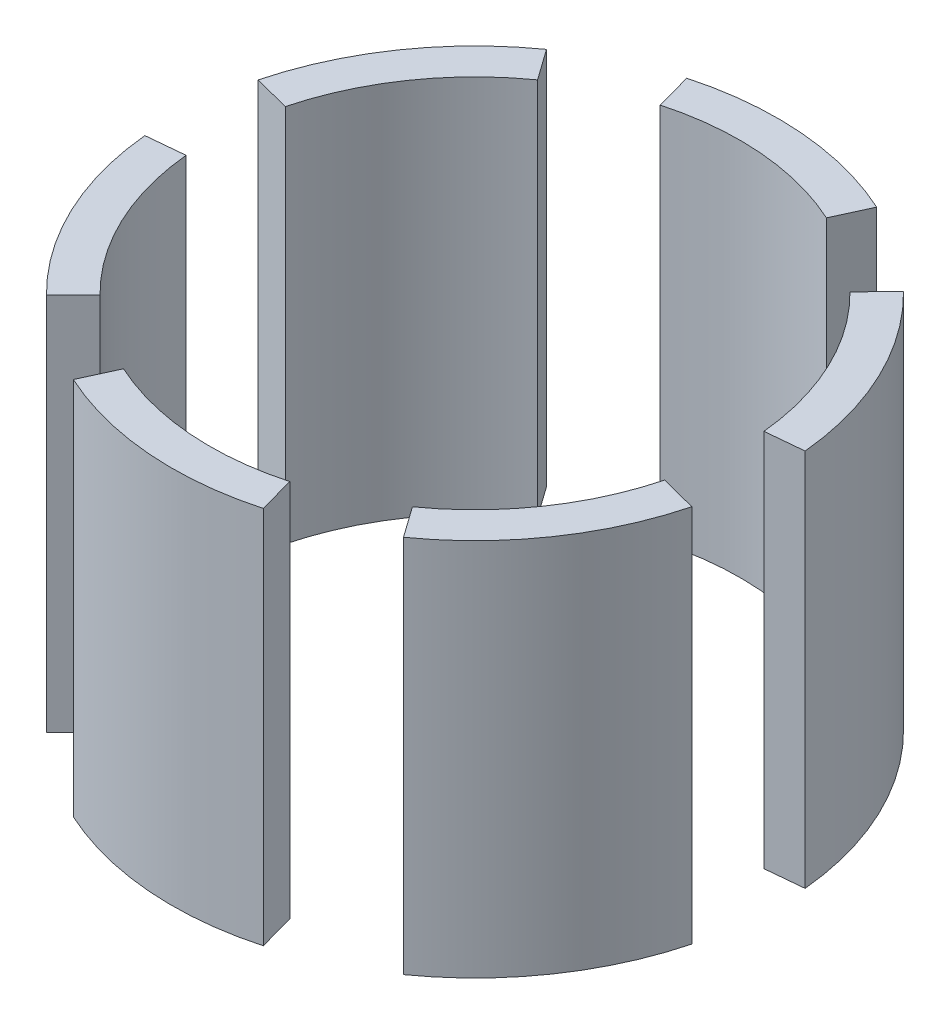
ISO-10303-21;
HEADER;
FILE_DESCRIPTION(('STEP AP214'),'2;1');
FILE_NAME('part.step','',(''),(''),'','','');
FILE_SCHEMA(('AUTOMOTIVE_DESIGN { 1 0 10303 214 1 1 1 1 }'));
ENDSEC;
DATA;
#1=APPLICATION_CONTEXT('core data for automotive mechanical design processes');
#2=APPLICATION_PROTOCOL_DEFINITION('international standard','automotive_design',2000,#1);
#3=PRODUCT_CONTEXT('',#1,'mechanical');
#4=PRODUCT('Part','Part','',(#3));
#5=PRODUCT_RELATED_PRODUCT_CATEGORY('part','',(#4));
#6=PRODUCT_DEFINITION_FORMATION('','',#4);
#7=PRODUCT_DEFINITION_CONTEXT('part definition',#1,'design');
#8=PRODUCT_DEFINITION('design','',#6,#7);
#9=PRODUCT_DEFINITION_SHAPE('','',#8);
#10=(LENGTH_UNIT() NAMED_UNIT(*) SI_UNIT(.MILLI.,.METRE.));
#11=(NAMED_UNIT(*) PLANE_ANGLE_UNIT() SI_UNIT($,.RADIAN.));
#12=(NAMED_UNIT(*) SI_UNIT($,.STERADIAN.) SOLID_ANGLE_UNIT());
#13=UNCERTAINTY_MEASURE_WITH_UNIT(LENGTH_MEASURE(1.E-05),#10,'distance_accuracy_value','');
#14=(GEOMETRIC_REPRESENTATION_CONTEXT(3) GLOBAL_UNCERTAINTY_ASSIGNED_CONTEXT((#13)) GLOBAL_UNIT_ASSIGNED_CONTEXT((#10,
#11,#12)) REPRESENTATION_CONTEXT('',''));
#15=CARTESIAN_POINT('',(0.,0.,0.));
#16=DIRECTION('',(0.,0.,1.));
#17=DIRECTION('',(1.,0.,0.));
#18=AXIS2_PLACEMENT_3D('',#15,#16,#17);
#19=CARTESIAN_POINT('',(0.,25.,0.));
#20=DIRECTION('',(-0.964116029770186,0.,0.265481225588879));
#21=DIRECTION('',(0.265481225588879,0.,0.964116029770186));
#22=AXIS2_PLACEMENT_3D('',#19,#20,#21);
#23=PLANE('',#22);
#24=DIRECTION('',(-0.265481225588879,0.,-0.964116029770186));
#25=VECTOR('',#24,1.);
#26=CARTESIAN_POINT('',(0.,0.,0.));
#27=LINE('',#26,#25);
#28=CARTESIAN_POINT('',(-4.64592144780538,0.,-16.8720305209783));
#29=VERTEX_POINT('',#28);
#30=CARTESIAN_POINT('',(-5.30962451177758,0.,-19.2823205954037));
#31=VERTEX_POINT('',#30);
#32=EDGE_CURVE('E198',#29,#31,#27,.T.);
#33=ORIENTED_EDGE('',*,*,#32,.F.);
#34=DIRECTION('',(0.,-1.,0.));
#35=VECTOR('',#34,1.);
#36=CARTESIAN_POINT('',(-4.64592144780538,25.,-16.8720305209783));
#37=LINE('',#36,#35);
#38=CARTESIAN_POINT('',(-4.64592144780538,25.,-16.8720305209783));
#39=VERTEX_POINT('',#38);
#40=EDGE_CURVE('E166',#29,#39,#37,.F.);
#41=ORIENTED_EDGE('',*,*,#40,.T.);
#42=DIRECTION('',(-0.265481225588879,0.,-0.964116029770186));
#43=VECTOR('',#42,1.);
#44=CARTESIAN_POINT('',(0.,25.,0.));
#45=LINE('',#44,#43);
#46=CARTESIAN_POINT('',(-5.30962451177758,25.,-19.2823205954037));
#47=VERTEX_POINT('',#46);
#48=EDGE_CURVE('E205',#39,#47,#45,.T.);
#49=ORIENTED_EDGE('',*,*,#48,.T.);
#50=DIRECTION('',(0.,-1.,0.));
#51=VECTOR('',#50,1.);
#52=CARTESIAN_POINT('',(-5.30962451177758,25.,-19.2823205954037));
#53=LINE('',#52,#51);
#54=EDGE_CURVE('E13',#47,#31,#53,.T.);
#55=ORIENTED_EDGE('',*,*,#54,.T.);
#56=EDGE_LOOP('',(#33,#41,#49,#55));
#57=FACE_BOUND('',#56,.T.);
#58=ADVANCED_FACE('F151',(#57),#23,.T.);
#59=CARTESIAN_POINT('',(0.,25.,0.));
#60=DIRECTION('',(0.909203769540316,0.,0.416351420621667));
#61=DIRECTION('',(0.416351420621667,0.,-0.909203769540316));
#62=AXIS2_PLACEMENT_3D('',#59,#60,#61);
#63=PLANE('',#62);
#64=DIRECTION('',(-0.416351420621667,0.,0.909203769540316));
#65=VECTOR('',#64,1.);
#66=CARTESIAN_POINT('',(0.,25.,0.));
#67=LINE('',#66,#65);
#68=CARTESIAN_POINT('',(8.32702841243334,25.,-18.1840753908063));
#69=VERTEX_POINT('',#68);
#70=CARTESIAN_POINT('',(7.28614986087917,25.,-15.9110659669555));
#71=VERTEX_POINT('',#70);
#72=EDGE_CURVE('E192',#69,#71,#67,.T.);
#73=ORIENTED_EDGE('',*,*,#72,.T.);
#74=DIRECTION('',(0.,-1.,0.));
#75=VECTOR('',#74,1.);
#76=CARTESIAN_POINT('',(7.28614986087917,25.,-15.9110659669555));
#77=LINE('',#76,#75);
#78=CARTESIAN_POINT('',(7.28614986087917,0.,-15.9110659669555));
#79=VERTEX_POINT('',#78);
#80=EDGE_CURVE('E203',#71,#79,#77,.T.);
#81=ORIENTED_EDGE('',*,*,#80,.T.);
#82=DIRECTION('',(-0.416351420621667,0.,0.909203769540316));
#83=VECTOR('',#82,1.);
#84=CARTESIAN_POINT('',(0.,0.,0.));
#85=LINE('',#84,#83);
#86=CARTESIAN_POINT('',(8.32702841243334,0.,-18.1840753908063));
#87=VERTEX_POINT('',#86);
#88=EDGE_CURVE('E196',#87,#79,#85,.T.);
#89=ORIENTED_EDGE('',*,*,#88,.F.);
#90=DIRECTION('',(0.,-1.,0.));
#91=VECTOR('',#90,1.);
#92=CARTESIAN_POINT('',(8.32702841243334,25.,-18.1840753908063));
#93=LINE('',#92,#91);
#94=EDGE_CURVE('E159',#69,#87,#93,.T.);
#95=ORIENTED_EDGE('',*,*,#94,.F.);
#96=EDGE_LOOP('',(#73,#81,#89,#95));
#97=FACE_BOUND('',#96,.T.);
#98=ADVANCED_FACE('F201',(#97),#63,.T.);
#99=CARTESIAN_POINT('',(0.,25.,0.));
#100=DIRECTION('',(0.,-1.,0.));
#101=DIRECTION('',(0.,0.,-1.));
#102=AXIS2_PLACEMENT_3D('',#99,#100,#101);
#103=CYLINDRICAL_SURFACE('',#102,20.);
#104=CARTESIAN_POINT('',(0.,0.,0.));
#105=DIRECTION('',(0.,1.,0.));
#106=DIRECTION('',(0.,0.,1.));
#107=AXIS2_PLACEMENT_3D('',#104,#105,#106);
#108=CIRCLE('',#107,20.);
#109=EDGE_CURVE('E188',#31,#87,#108,.F.);
#110=ORIENTED_EDGE('',*,*,#109,.F.);
#111=ORIENTED_EDGE('',*,*,#54,.F.);
#112=CARTESIAN_POINT('',(0.,25.,0.));
#113=DIRECTION('',(0.,1.,0.));
#114=DIRECTION('',(0.,0.,1.));
#115=AXIS2_PLACEMENT_3D('',#112,#113,#114);
#116=CIRCLE('',#115,20.);
#117=EDGE_CURVE('E190',#47,#69,#116,.F.);
#118=ORIENTED_EDGE('',*,*,#117,.T.);
#119=ORIENTED_EDGE('',*,*,#94,.T.);
#120=EDGE_LOOP('',(#110,#111,#118,#119));
#121=FACE_BOUND('',#120,.T.);
#122=ADVANCED_FACE('F153',(#121),#103,.T.);
#123=CARTESIAN_POINT('',(0.,25.,0.));
#124=DIRECTION('',(0.,1.,0.));
#125=DIRECTION('',(0.,0.,1.));
#126=AXIS2_PLACEMENT_3D('',#123,#124,#125);
#127=PLANE('',#126);
#128=ORIENTED_EDGE('',*,*,#48,.F.);
#129=CARTESIAN_POINT('',(0.,25.,0.));
#130=DIRECTION('',(0.,1.,0.));
#131=DIRECTION('',(0.,0.,1.));
#132=AXIS2_PLACEMENT_3D('',#129,#130,#131);
#133=CIRCLE('',#132,17.5);
#134=EDGE_CURVE('E213',#71,#39,#133,.T.);
#135=ORIENTED_EDGE('',*,*,#134,.F.);
#136=ORIENTED_EDGE('',*,*,#72,.F.);
#137=ORIENTED_EDGE('',*,*,#117,.F.);
#138=EDGE_LOOP('',(#128,#135,#136,#137));
#139=FACE_BOUND('',#138,.T.);
#140=ADVANCED_FACE('F224',(#139),#127,.T.);
#141=CARTESIAN_POINT('',(0.,0.,0.));
#142=DIRECTION('',(0.,1.,0.));
#143=DIRECTION('',(0.,0.,1.));
#144=AXIS2_PLACEMENT_3D('',#141,#142,#143);
#145=PLANE('',#144);
#146=CARTESIAN_POINT('',(0.,0.,0.));
#147=DIRECTION('',(0.,1.,0.));
#148=DIRECTION('',(0.,0.,1.));
#149=AXIS2_PLACEMENT_3D('',#146,#147,#148);
#150=CIRCLE('',#149,17.5);
#151=EDGE_CURVE('E214',#79,#29,#150,.T.);
#152=ORIENTED_EDGE('',*,*,#151,.T.);
#153=ORIENTED_EDGE('',*,*,#32,.T.);
#154=ORIENTED_EDGE('',*,*,#109,.T.);
#155=ORIENTED_EDGE('',*,*,#88,.T.);
#156=EDGE_LOOP('',(#152,#153,#154,#155));
#157=FACE_BOUND('',#156,.T.);
#158=ADVANCED_FACE('F195',(#157),#145,.F.);
#159=CARTESIAN_POINT('',(0.,25.,0.));
#160=DIRECTION('',(0.,-1.,0.));
#161=DIRECTION('',(0.,0.,-1.));
#162=AXIS2_PLACEMENT_3D('',#159,#160,#161);
#163=CYLINDRICAL_SURFACE('',#162,17.5);
#164=ORIENTED_EDGE('',*,*,#151,.F.);
#165=ORIENTED_EDGE('',*,*,#80,.F.);
#166=ORIENTED_EDGE('',*,*,#134,.T.);
#167=ORIENTED_EDGE('',*,*,#40,.F.);
#168=EDGE_LOOP('',(#164,#165,#166,#167));
#169=FACE_BOUND('',#168,.T.);
#170=ADVANCED_FACE('F218',(#169),#163,.F.);
#171=CLOSED_SHELL('',(#58,#98,#122,#140,#158,#170));
#172=MANIFOLD_SOLID_BREP('B2',#171);
#173=CARTESIAN_POINT('',(0.,25.,0.));
#174=DIRECTION('',(-0.711971500472888,0.,-0.702208361182338));
#175=DIRECTION('',(-0.702208361182338,0.,0.711971500472888));
#176=AXIS2_PLACEMENT_3D('',#173,#174,#175);
#177=PLANE('',#176);
#178=DIRECTION('',(0.702208361182338,0.,-0.711971500472888));
#179=VECTOR('',#178,1.);
#180=CARTESIAN_POINT('',(0.,0.,0.));
#181=LINE('',#180,#179);
#182=CARTESIAN_POINT('',(12.2886463206909,0.,-12.4595012582755));
#183=VERTEX_POINT('',#182);
#184=CARTESIAN_POINT('',(14.0441672236468,0.,-14.2394300094578));
#185=VERTEX_POINT('',#184);
#186=EDGE_CURVE('E331',#183,#185,#181,.T.);
#187=ORIENTED_EDGE('',*,*,#186,.F.);
#188=DIRECTION('',(0.,-1.,0.));
#189=VECTOR('',#188,1.);
#190=CARTESIAN_POINT('',(12.2886463206909,25.,-12.4595012582755));
#191=LINE('',#190,#189);
#192=CARTESIAN_POINT('',(12.2886463206909,25.,-12.4595012582755));
#193=VERTEX_POINT('',#192);
#194=EDGE_CURVE('E299',#183,#193,#191,.F.);
#195=ORIENTED_EDGE('',*,*,#194,.T.);
#196=DIRECTION('',(0.702208361182338,0.,-0.711971500472888));
#197=VECTOR('',#196,1.);
#198=CARTESIAN_POINT('',(0.,25.,0.));
#199=LINE('',#198,#197);
#200=CARTESIAN_POINT('',(14.0441672236468,25.,-14.2394300094578));
#201=VERTEX_POINT('',#200);
#202=EDGE_CURVE('E338',#193,#201,#199,.T.);
#203=ORIENTED_EDGE('',*,*,#202,.T.);
#204=DIRECTION('',(0.,-1.,0.));
#205=VECTOR('',#204,1.);
#206=CARTESIAN_POINT('',(14.0441672236468,25.,-14.2394300094578));
#207=LINE('',#206,#205);
#208=EDGE_CURVE('E149',#201,#185,#207,.T.);
#209=ORIENTED_EDGE('',*,*,#208,.T.);
#210=EDGE_LOOP('',(#187,#195,#203,#209));
#211=FACE_BOUND('',#210,.T.);
#212=ADVANCED_FACE('F284',(#211),#177,.T.);
#213=CARTESIAN_POINT('',(0.,25.,0.));
#214=DIRECTION('',(0.0940309776100518,0.,0.995569271949319));
#215=DIRECTION('',(0.995569271949319,0.,-0.0940309776100518));
#216=AXIS2_PLACEMENT_3D('',#213,#214,#215);
#217=PLANE('',#216);
#218=DIRECTION('',(-0.995569271949319,0.,0.0940309776100518));
#219=VECTOR('',#218,1.);
#220=CARTESIAN_POINT('',(0.,25.,0.));
#221=LINE('',#220,#219);
#222=CARTESIAN_POINT('',(19.9113854389864,25.,-1.88061955220104));
#223=VERTEX_POINT('',#222);
#224=CARTESIAN_POINT('',(17.4224622591131,25.,-1.64554210817591));
#225=VERTEX_POINT('',#224);
#226=EDGE_CURVE('E325',#223,#225,#221,.T.);
#227=ORIENTED_EDGE('',*,*,#226,.T.);
#228=DIRECTION('',(0.,-1.,0.));
#229=VECTOR('',#228,1.);
#230=CARTESIAN_POINT('',(17.4224622591131,25.,-1.64554210817591));
#231=LINE('',#230,#229);
#232=CARTESIAN_POINT('',(17.4224622591131,0.,-1.64554210817591));
#233=VERTEX_POINT('',#232);
#234=EDGE_CURVE('E336',#225,#233,#231,.T.);
#235=ORIENTED_EDGE('',*,*,#234,.T.);
#236=DIRECTION('',(-0.995569271949319,0.,0.0940309776100518));
#237=VECTOR('',#236,1.);
#238=CARTESIAN_POINT('',(0.,0.,0.));
#239=LINE('',#238,#237);
#240=CARTESIAN_POINT('',(19.9113854389864,0.,-1.88061955220104));
#241=VERTEX_POINT('',#240);
#242=EDGE_CURVE('E329',#241,#233,#239,.T.);
#243=ORIENTED_EDGE('',*,*,#242,.F.);
#244=DIRECTION('',(0.,-1.,0.));
#245=VECTOR('',#244,1.);
#246=CARTESIAN_POINT('',(19.9113854389864,25.,-1.88061955220104));
#247=LINE('',#246,#245);
#248=EDGE_CURVE('E292',#223,#241,#247,.T.);
#249=ORIENTED_EDGE('',*,*,#248,.F.);
#250=EDGE_LOOP('',(#227,#235,#243,#249));
#251=FACE_BOUND('',#250,.T.);
#252=ADVANCED_FACE('F334',(#251),#217,.T.);
#253=CARTESIAN_POINT('',(0.,25.,0.));
#254=DIRECTION('',(0.,-1.,0.));
#255=DIRECTION('',(0.,0.,-1.));
#256=AXIS2_PLACEMENT_3D('',#253,#254,#255);
#257=CYLINDRICAL_SURFACE('',#256,20.);
#258=CARTESIAN_POINT('',(0.,0.,0.));
#259=DIRECTION('',(0.,1.,0.));
#260=DIRECTION('',(0.,0.,1.));
#261=AXIS2_PLACEMENT_3D('',#258,#259,#260);
#262=CIRCLE('',#261,20.);
#263=EDGE_CURVE('E321',#185,#241,#262,.F.);
#264=ORIENTED_EDGE('',*,*,#263,.F.);
#265=ORIENTED_EDGE('',*,*,#208,.F.);
#266=CARTESIAN_POINT('',(0.,25.,0.));
#267=DIRECTION('',(0.,1.,0.));
#268=DIRECTION('',(0.,0.,1.));
#269=AXIS2_PLACEMENT_3D('',#266,#267,#268);
#270=CIRCLE('',#269,20.);
#271=EDGE_CURVE('E323',#201,#223,#270,.F.);
#272=ORIENTED_EDGE('',*,*,#271,.T.);
#273=ORIENTED_EDGE('',*,*,#248,.T.);
#274=EDGE_LOOP('',(#264,#265,#272,#273));
#275=FACE_BOUND('',#274,.T.);
#276=ADVANCED_FACE('F286',(#275),#257,.T.);
#277=CARTESIAN_POINT('',(0.,25.,0.));
#278=DIRECTION('',(0.,1.,0.));
#279=DIRECTION('',(0.,0.,1.));
#280=AXIS2_PLACEMENT_3D('',#277,#278,#279);
#281=PLANE('',#280);
#282=ORIENTED_EDGE('',*,*,#202,.F.);
#283=CARTESIAN_POINT('',(0.,25.,0.));
#284=DIRECTION('',(0.,1.,0.));
#285=DIRECTION('',(0.,0.,1.));
#286=AXIS2_PLACEMENT_3D('',#283,#284,#285);
#287=CIRCLE('',#286,17.5);
#288=EDGE_CURVE('E346',#225,#193,#287,.T.);
#289=ORIENTED_EDGE('',*,*,#288,.F.);
#290=ORIENTED_EDGE('',*,*,#226,.F.);
#291=ORIENTED_EDGE('',*,*,#271,.F.);
#292=EDGE_LOOP('',(#282,#289,#290,#291));
#293=FACE_BOUND('',#292,.T.);
#294=ADVANCED_FACE('F357',(#293),#281,.T.);
#295=CARTESIAN_POINT('',(0.,0.,0.));
#296=DIRECTION('',(0.,1.,0.));
#297=DIRECTION('',(0.,0.,1.));
#298=AXIS2_PLACEMENT_3D('',#295,#296,#297);
#299=PLANE('',#298);
#300=CARTESIAN_POINT('',(0.,0.,0.));
#301=DIRECTION('',(0.,1.,0.));
#302=DIRECTION('',(0.,0.,1.));
#303=AXIS2_PLACEMENT_3D('',#300,#301,#302);
#304=CIRCLE('',#303,17.5);
#305=EDGE_CURVE('E347',#233,#183,#304,.T.);
#306=ORIENTED_EDGE('',*,*,#305,.T.);
#307=ORIENTED_EDGE('',*,*,#186,.T.);
#308=ORIENTED_EDGE('',*,*,#263,.T.);
#309=ORIENTED_EDGE('',*,*,#242,.T.);
#310=EDGE_LOOP('',(#306,#307,#308,#309));
#311=FACE_BOUND('',#310,.T.);
#312=ADVANCED_FACE('F328',(#311),#299,.F.);
#313=CARTESIAN_POINT('',(0.,25.,0.));
#314=DIRECTION('',(0.,-1.,0.));
#315=DIRECTION('',(0.,0.,-1.));
#316=AXIS2_PLACEMENT_3D('',#313,#314,#315);
#317=CYLINDRICAL_SURFACE('',#316,17.5);
#318=ORIENTED_EDGE('',*,*,#305,.F.);
#319=ORIENTED_EDGE('',*,*,#234,.F.);
#320=ORIENTED_EDGE('',*,*,#288,.T.);
#321=ORIENTED_EDGE('',*,*,#194,.F.);
#322=EDGE_LOOP('',(#318,#319,#320,#321));
#323=FACE_BOUND('',#322,.T.);
#324=ADVANCED_FACE('F351',(#323),#317,.F.);
#325=CLOSED_SHELL('',(#212,#252,#276,#294,#312,#324));
#326=MANIFOLD_SOLID_BREP('B7',#325);
#327=CARTESIAN_POINT('',(0.,25.,0.));
#328=DIRECTION('',(0.252144529297301,0.,-0.967689586771214));
#329=DIRECTION('',(-0.967689586771214,0.,-0.252144529297301));
#330=AXIS2_PLACEMENT_3D('',#327,#328,#329);
#331=PLANE('',#330);
#332=DIRECTION('',(0.967689586771214,0.,0.252144529297301));
#333=VECTOR('',#332,1.);
#334=CARTESIAN_POINT('',(0.,0.,0.));
#335=LINE('',#334,#333);
#336=CARTESIAN_POINT('',(16.9345677684962,0.,4.41252926270277));
#337=VERTEX_POINT('',#336);
#338=CARTESIAN_POINT('',(19.3537917354243,0.,5.04289058594602));
#339=VERTEX_POINT('',#338);
#340=EDGE_CURVE('E464',#337,#339,#335,.T.);
#341=ORIENTED_EDGE('',*,*,#340,.F.);
#342=DIRECTION('',(0.,-1.,0.));
#343=VECTOR('',#342,1.);
#344=CARTESIAN_POINT('',(16.9345677684962,25.,4.41252926270277));
#345=LINE('',#344,#343);
#346=CARTESIAN_POINT('',(16.9345677684962,25.,4.41252926270277));
#347=VERTEX_POINT('',#346);
#348=EDGE_CURVE('E432',#337,#347,#345,.F.);
#349=ORIENTED_EDGE('',*,*,#348,.T.);
#350=DIRECTION('',(0.967689586771214,0.,0.252144529297301));
#351=VECTOR('',#350,1.);
#352=CARTESIAN_POINT('',(0.,25.,0.));
#353=LINE('',#352,#351);
#354=CARTESIAN_POINT('',(19.3537917354243,25.,5.04289058594602));
#355=VERTEX_POINT('',#354);
#356=EDGE_CURVE('E471',#347,#355,#353,.T.);
#357=ORIENTED_EDGE('',*,*,#356,.T.);
#358=DIRECTION('',(0.,-1.,0.));
#359=VECTOR('',#358,1.);
#360=CARTESIAN_POINT('',(19.3537917354243,25.,5.04289058594602));
#361=LINE('',#360,#359);
#362=EDGE_CURVE('E282',#355,#339,#361,.T.);
#363=ORIENTED_EDGE('',*,*,#362,.T.);
#364=EDGE_LOOP('',(#341,#349,#357,#363));
#365=FACE_BOUND('',#364,.T.);
#366=ADVANCED_FACE('F417',(#365),#331,.T.);
#367=CARTESIAN_POINT('',(0.,25.,0.));
#368=DIRECTION('',(-0.815172791930264,0.,0.579217851327648));
#369=DIRECTION('',(0.579217851327648,0.,0.815172791930264));
#370=AXIS2_PLACEMENT_3D('',#367,#368,#369);
#371=PLANE('',#370);
#372=DIRECTION('',(-0.579217851327648,0.,-0.815172791930264));
#373=VECTOR('',#372,1.);
#374=CARTESIAN_POINT('',(0.,25.,0.));
#375=LINE('',#374,#373);
#376=CARTESIAN_POINT('',(11.584357026553,25.,16.3034558386053));
#377=VERTEX_POINT('',#376);
#378=CARTESIAN_POINT('',(10.1363123982338,25.,14.2655238587796));
#379=VERTEX_POINT('',#378);
#380=EDGE_CURVE('E458',#377,#379,#375,.T.);
#381=ORIENTED_EDGE('',*,*,#380,.T.);
#382=DIRECTION('',(0.,-1.,0.));
#383=VECTOR('',#382,1.);
#384=CARTESIAN_POINT('',(10.1363123982338,25.,14.2655238587796));
#385=LINE('',#384,#383);
#386=CARTESIAN_POINT('',(10.1363123982338,0.,14.2655238587796));
#387=VERTEX_POINT('',#386);
#388=EDGE_CURVE('E469',#379,#387,#385,.T.);
#389=ORIENTED_EDGE('',*,*,#388,.T.);
#390=DIRECTION('',(-0.579217851327648,0.,-0.815172791930264));
#391=VECTOR('',#390,1.);
#392=CARTESIAN_POINT('',(0.,0.,0.));
#393=LINE('',#392,#391);
#394=CARTESIAN_POINT('',(11.584357026553,0.,16.3034558386053));
#395=VERTEX_POINT('',#394);
#396=EDGE_CURVE('E462',#395,#387,#393,.T.);
#397=ORIENTED_EDGE('',*,*,#396,.F.);
#398=DIRECTION('',(0.,-1.,0.));
#399=VECTOR('',#398,1.);
#400=CARTESIAN_POINT('',(11.584357026553,25.,16.3034558386053));
#401=LINE('',#400,#399);
#402=EDGE_CURVE('E425',#377,#395,#401,.T.);
#403=ORIENTED_EDGE('',*,*,#402,.F.);
#404=EDGE_LOOP('',(#381,#389,#397,#403));
#405=FACE_BOUND('',#404,.T.);
#406=ADVANCED_FACE('F467',(#405),#371,.T.);
#407=CARTESIAN_POINT('',(0.,25.,0.));
#408=DIRECTION('',(0.,-1.,0.));
#409=DIRECTION('',(0.,0.,-1.));
#410=AXIS2_PLACEMENT_3D('',#407,#408,#409);
#411=CYLINDRICAL_SURFACE('',#410,20.);
#412=CARTESIAN_POINT('',(0.,0.,0.));
#413=DIRECTION('',(0.,1.,0.));
#414=DIRECTION('',(0.,0.,1.));
#415=AXIS2_PLACEMENT_3D('',#412,#413,#414);
#416=CIRCLE('',#415,20.);
#417=EDGE_CURVE('E454',#339,#395,#416,.F.);
#418=ORIENTED_EDGE('',*,*,#417,.F.);
#419=ORIENTED_EDGE('',*,*,#362,.F.);
#420=CARTESIAN_POINT('',(0.,25.,0.));
#421=DIRECTION('',(0.,1.,0.));
#422=DIRECTION('',(0.,0.,1.));
#423=AXIS2_PLACEMENT_3D('',#420,#421,#422);
#424=CIRCLE('',#423,20.);
#425=EDGE_CURVE('E456',#355,#377,#424,.F.);
#426=ORIENTED_EDGE('',*,*,#425,.T.);
#427=ORIENTED_EDGE('',*,*,#402,.T.);
#428=EDGE_LOOP('',(#418,#419,#426,#427));
#429=FACE_BOUND('',#428,.T.);
#430=ADVANCED_FACE('F419',(#429),#411,.T.);
#431=CARTESIAN_POINT('',(0.,25.,0.));
#432=DIRECTION('',(0.,1.,0.));
#433=DIRECTION('',(0.,0.,1.));
#434=AXIS2_PLACEMENT_3D('',#431,#432,#433);
#435=PLANE('',#434);
#436=ORIENTED_EDGE('',*,*,#356,.F.);
#437=CARTESIAN_POINT('',(0.,25.,0.));
#438=DIRECTION('',(0.,1.,0.));
#439=DIRECTION('',(0.,0.,1.));
#440=AXIS2_PLACEMENT_3D('',#437,#438,#439);
#441=CIRCLE('',#440,17.5);
#442=EDGE_CURVE('E479',#379,#347,#441,.T.);
#443=ORIENTED_EDGE('',*,*,#442,.F.);
#444=ORIENTED_EDGE('',*,*,#380,.F.);
#445=ORIENTED_EDGE('',*,*,#425,.F.);
#446=EDGE_LOOP('',(#436,#443,#444,#445));
#447=FACE_BOUND('',#446,.T.);
#448=ADVANCED_FACE('F490',(#447),#435,.T.);
#449=CARTESIAN_POINT('',(0.,0.,0.));
#450=DIRECTION('',(0.,1.,0.));
#451=DIRECTION('',(0.,0.,1.));
#452=AXIS2_PLACEMENT_3D('',#449,#450,#451);
#453=PLANE('',#452);
#454=CARTESIAN_POINT('',(0.,0.,0.));
#455=DIRECTION('',(0.,1.,0.));
#456=DIRECTION('',(0.,0.,1.));
#457=AXIS2_PLACEMENT_3D('',#454,#455,#456);
#458=CIRCLE('',#457,17.5);
#459=EDGE_CURVE('E480',#387,#337,#458,.T.);
#460=ORIENTED_EDGE('',*,*,#459,.T.);
#461=ORIENTED_EDGE('',*,*,#340,.T.);
#462=ORIENTED_EDGE('',*,*,#417,.T.);
#463=ORIENTED_EDGE('',*,*,#396,.T.);
#464=EDGE_LOOP('',(#460,#461,#462,#463));
#465=FACE_BOUND('',#464,.T.);
#466=ADVANCED_FACE('F461',(#465),#453,.F.);
#467=CARTESIAN_POINT('',(0.,25.,0.));
#468=DIRECTION('',(0.,-1.,0.));
#469=DIRECTION('',(0.,0.,-1.));
#470=AXIS2_PLACEMENT_3D('',#467,#468,#469);
#471=CYLINDRICAL_SURFACE('',#470,17.5);
#472=ORIENTED_EDGE('',*,*,#459,.F.);
#473=ORIENTED_EDGE('',*,*,#388,.F.);
#474=ORIENTED_EDGE('',*,*,#442,.T.);
#475=ORIENTED_EDGE('',*,*,#348,.F.);
#476=EDGE_LOOP('',(#472,#473,#474,#475));
#477=FACE_BOUND('',#476,.T.);
#478=ADVANCED_FACE('F484',(#477),#471,.F.);
#479=CLOSED_SHELL('',(#366,#406,#430,#448,#466,#478));
#480=MANIFOLD_SOLID_BREP('B143',#479);
#481=CARTESIAN_POINT('',(0.,25.,0.));
#482=DIRECTION('',(0.964116029770185,0.,-0.265481225588886));
#483=DIRECTION('',(-0.265481225588886,0.,-0.964116029770185));
#484=AXIS2_PLACEMENT_3D('',#481,#482,#483);
#485=PLANE('',#484);
#486=DIRECTION('',(0.265481225588886,0.,0.964116029770185));
#487=VECTOR('',#486,1.);
#488=CARTESIAN_POINT('',(0.,0.,0.));
#489=LINE('',#488,#487);
#490=CARTESIAN_POINT('',(4.6459214478055,0.,16.8720305209782));
#491=VERTEX_POINT('',#490);
#492=CARTESIAN_POINT('',(5.30962451177771,0.,19.2823205954037));
#493=VERTEX_POINT('',#492);
#494=EDGE_CURVE('E598',#491,#493,#489,.T.);
#495=ORIENTED_EDGE('',*,*,#494,.F.);
#496=DIRECTION('',(0.,-1.,0.));
#497=VECTOR('',#496,1.);
#498=CARTESIAN_POINT('',(4.6459214478055,25.,16.8720305209782));
#499=LINE('',#498,#497);
#500=CARTESIAN_POINT('',(4.6459214478055,25.,16.8720305209782));
#501=VERTEX_POINT('',#500);
#502=EDGE_CURVE('E564',#491,#501,#499,.F.);
#503=ORIENTED_EDGE('',*,*,#502,.T.);
#504=DIRECTION('',(0.265481225588886,0.,0.964116029770185));
#505=VECTOR('',#504,1.);
#506=CARTESIAN_POINT('',(0.,25.,0.));
#507=LINE('',#506,#505);
#508=CARTESIAN_POINT('',(5.30962451177771,25.,19.2823205954037));
#509=VERTEX_POINT('',#508);
#510=EDGE_CURVE('E606',#501,#509,#507,.T.);
#511=ORIENTED_EDGE('',*,*,#510,.T.);
#512=DIRECTION('',(0.,-1.,0.));
#513=VECTOR('',#512,1.);
#514=CARTESIAN_POINT('',(5.30962451177771,25.,19.2823205954037));
#515=LINE('',#514,#513);
#516=EDGE_CURVE('E558',#509,#493,#515,.T.);
#517=ORIENTED_EDGE('',*,*,#516,.T.);
#518=EDGE_LOOP('',(#495,#503,#511,#517));
#519=FACE_BOUND('',#518,.T.);
#520=ADVANCED_FACE('F550',(#519),#485,.T.);
#521=CARTESIAN_POINT('',(0.,25.,0.));
#522=DIRECTION('',(-0.909203769540319,0.,-0.416351420621661));
#523=DIRECTION('',(-0.416351420621661,0.,0.909203769540319));
#524=AXIS2_PLACEMENT_3D('',#521,#522,#523);
#525=PLANE('',#524);
#526=DIRECTION('',(0.416351420621661,0.,-0.909203769540319));
#527=VECTOR('',#526,1.);
#528=CARTESIAN_POINT('',(0.,25.,0.));
#529=LINE('',#528,#527);
#530=CARTESIAN_POINT('',(-8.32702841243322,25.,18.1840753908064));
#531=VERTEX_POINT('',#530);
#532=CARTESIAN_POINT('',(-7.28614986087906,25.,15.9110659669556));
#533=VERTEX_POINT('',#532);
#534=EDGE_CURVE('E591',#531,#533,#529,.T.);
#535=ORIENTED_EDGE('',*,*,#534,.T.);
#536=DIRECTION('',(0.,-1.,0.));
#537=VECTOR('',#536,1.);
#538=CARTESIAN_POINT('',(-7.28614986087906,25.,15.9110659669556));
#539=LINE('',#538,#537);
#540=CARTESIAN_POINT('',(-7.28614986087906,0.,15.9110659669556));
#541=VERTEX_POINT('',#540);
#542=EDGE_CURVE('E604',#533,#541,#539,.T.);
#543=ORIENTED_EDGE('',*,*,#542,.T.);
#544=DIRECTION('',(0.416351420621661,0.,-0.909203769540319));
#545=VECTOR('',#544,1.);
#546=CARTESIAN_POINT('',(0.,0.,0.));
#547=LINE('',#546,#545);
#548=CARTESIAN_POINT('',(-8.32702841243322,0.,18.1840753908064));
#549=VERTEX_POINT('',#548);
#550=EDGE_CURVE('E596',#549,#541,#547,.T.);
#551=ORIENTED_EDGE('',*,*,#550,.F.);
#552=DIRECTION('',(0.,-1.,0.));
#553=VECTOR('',#552,1.);
#554=CARTESIAN_POINT('',(-8.32702841243322,25.,18.1840753908064));
#555=LINE('',#554,#553);
#556=EDGE_CURVE('E573',#531,#549,#555,.T.);
#557=ORIENTED_EDGE('',*,*,#556,.F.);
#558=EDGE_LOOP('',(#535,#543,#551,#557));
#559=FACE_BOUND('',#558,.T.);
#560=ADVANCED_FACE('F602',(#559),#525,.T.);
#561=CARTESIAN_POINT('',(0.,25.,0.));
#562=DIRECTION('',(0.,-1.,0.));
#563=DIRECTION('',(0.,0.,-1.));
#564=AXIS2_PLACEMENT_3D('',#561,#562,#563);
#565=CYLINDRICAL_SURFACE('',#564,20.);
#566=CARTESIAN_POINT('',(0.,0.,0.));
#567=DIRECTION('',(0.,1.,0.));
#568=DIRECTION('',(0.,0.,1.));
#569=AXIS2_PLACEMENT_3D('',#566,#567,#568);
#570=CIRCLE('',#569,20.);
#571=EDGE_CURVE('E587',#493,#549,#570,.F.);
#572=ORIENTED_EDGE('',*,*,#571,.F.);
#573=ORIENTED_EDGE('',*,*,#516,.F.);
#574=CARTESIAN_POINT('',(0.,25.,0.));
#575=DIRECTION('',(0.,1.,0.));
#576=DIRECTION('',(0.,0.,1.));
#577=AXIS2_PLACEMENT_3D('',#574,#575,#576);
#578=CIRCLE('',#577,20.);
#579=EDGE_CURVE('E589',#509,#531,#578,.F.);
#580=ORIENTED_EDGE('',*,*,#579,.T.);
#581=ORIENTED_EDGE('',*,*,#556,.T.);
#582=EDGE_LOOP('',(#572,#573,#580,#581));
#583=FACE_BOUND('',#582,.T.);
#584=ADVANCED_FACE('F552',(#583),#565,.T.);
#585=CARTESIAN_POINT('',(0.,25.,0.));
#586=DIRECTION('',(0.,1.,0.));
#587=DIRECTION('',(0.,0.,1.));
#588=AXIS2_PLACEMENT_3D('',#585,#586,#587);
#589=PLANE('',#588);
#590=ORIENTED_EDGE('',*,*,#510,.F.);
#591=CARTESIAN_POINT('',(0.,25.,0.));
#592=DIRECTION('',(0.,1.,0.));
#593=DIRECTION('',(0.,0.,1.));
#594=AXIS2_PLACEMENT_3D('',#591,#592,#593);
#595=CIRCLE('',#594,17.5);
#596=EDGE_CURVE('E616',#533,#501,#595,.T.);
#597=ORIENTED_EDGE('',*,*,#596,.F.);
#598=ORIENTED_EDGE('',*,*,#534,.F.);
#599=ORIENTED_EDGE('',*,*,#579,.F.);
#600=EDGE_LOOP('',(#590,#597,#598,#599));
#601=FACE_BOUND('',#600,.T.);
#602=ADVANCED_FACE('F612',(#601),#589,.T.);
#603=CARTESIAN_POINT('',(0.,0.,0.));
#604=DIRECTION('',(0.,1.,0.));
#605=DIRECTION('',(0.,0.,1.));
#606=AXIS2_PLACEMENT_3D('',#603,#604,#605);
#607=PLANE('',#606);
#608=CARTESIAN_POINT('',(0.,0.,0.));
#609=DIRECTION('',(0.,1.,0.));
#610=DIRECTION('',(0.,0.,1.));
#611=AXIS2_PLACEMENT_3D('',#608,#609,#610);
#612=CIRCLE('',#611,17.5);
#613=EDGE_CURVE('E415',#491,#541,#612,.F.);
#614=ORIENTED_EDGE('',*,*,#613,.F.);
#615=ORIENTED_EDGE('',*,*,#494,.T.);
#616=ORIENTED_EDGE('',*,*,#571,.T.);
#617=ORIENTED_EDGE('',*,*,#550,.T.);
#618=EDGE_LOOP('',(#614,#615,#616,#617));
#619=FACE_BOUND('',#618,.T.);
#620=ADVANCED_FACE('F595',(#619),#607,.F.);
#621=CARTESIAN_POINT('',(0.,25.,0.));
#622=DIRECTION('',(0.,-1.,0.));
#623=DIRECTION('',(0.,0.,-1.));
#624=AXIS2_PLACEMENT_3D('',#621,#622,#623);
#625=CYLINDRICAL_SURFACE('',#624,17.5);
#626=ORIENTED_EDGE('',*,*,#613,.T.);
#627=ORIENTED_EDGE('',*,*,#542,.F.);
#628=ORIENTED_EDGE('',*,*,#596,.T.);
#629=ORIENTED_EDGE('',*,*,#502,.F.);
#630=EDGE_LOOP('',(#626,#627,#628,#629));
#631=FACE_BOUND('',#630,.T.);
#632=ADVANCED_FACE('F622',(#631),#625,.F.);
#633=CLOSED_SHELL('',(#520,#560,#584,#602,#620,#632));
#634=MANIFOLD_SOLID_BREP('B276',#633);
#635=CARTESIAN_POINT('',(0.,25.,0.));
#636=DIRECTION('',(0.711971500472893,0.,0.702208361182333));
#637=DIRECTION('',(0.702208361182333,0.,-0.711971500472893));
#638=AXIS2_PLACEMENT_3D('',#635,#636,#637);
#639=PLANE('',#638);
#640=DIRECTION('',(-0.702208361182333,0.,0.711971500472893));
#641=VECTOR('',#640,1.);
#642=CARTESIAN_POINT('',(0.,0.,0.));
#643=LINE('',#642,#641);
#644=CARTESIAN_POINT('',(-12.2886463206908,0.,12.4595012582756));
#645=VERTEX_POINT('',#644);
#646=CARTESIAN_POINT('',(-14.0441672236467,0.,14.2394300094579));
#647=VERTEX_POINT('',#646);
#648=EDGE_CURVE('E729',#645,#647,#643,.T.);
#649=ORIENTED_EDGE('',*,*,#648,.F.);
#650=DIRECTION('',(0.,-1.,0.));
#651=VECTOR('',#650,1.);
#652=CARTESIAN_POINT('',(-12.2886463206908,25.,12.4595012582756));
#653=LINE('',#652,#651);
#654=CARTESIAN_POINT('',(-12.2886463206908,25.,12.4595012582756));
#655=VERTEX_POINT('',#654);
#656=EDGE_CURVE('E697',#645,#655,#653,.F.);
#657=ORIENTED_EDGE('',*,*,#656,.T.);
#658=DIRECTION('',(-0.702208361182333,0.,0.711971500472893));
#659=VECTOR('',#658,1.);
#660=CARTESIAN_POINT('',(0.,25.,0.));
#661=LINE('',#660,#659);
#662=CARTESIAN_POINT('',(-14.0441672236467,25.,14.2394300094579));
#663=VERTEX_POINT('',#662);
#664=EDGE_CURVE('E736',#655,#663,#661,.T.);
#665=ORIENTED_EDGE('',*,*,#664,.T.);
#666=DIRECTION('',(0.,-1.,0.));
#667=VECTOR('',#666,1.);
#668=CARTESIAN_POINT('',(-14.0441672236467,25.,14.2394300094579));
#669=LINE('',#668,#667);
#670=EDGE_CURVE('E548',#663,#647,#669,.T.);
#671=ORIENTED_EDGE('',*,*,#670,.T.);
#672=EDGE_LOOP('',(#649,#657,#665,#671));
#673=FACE_BOUND('',#672,.T.);
#674=ADVANCED_FACE('F682',(#673),#639,.T.);
#675=CARTESIAN_POINT('',(0.,25.,0.));
#676=DIRECTION('',(-0.0940309776100569,0.,-0.995569271949319));
#677=DIRECTION('',(-0.995569271949319,0.,0.0940309776100569));
#678=AXIS2_PLACEMENT_3D('',#675,#676,#677);
#679=PLANE('',#678);
#680=DIRECTION('',(0.995569271949319,0.,-0.0940309776100569));
#681=VECTOR('',#680,1.);
#682=CARTESIAN_POINT('',(0.,25.,0.));
#683=LINE('',#682,#681);
#684=CARTESIAN_POINT('',(-19.9113854389864,25.,1.88061955220114));
#685=VERTEX_POINT('',#684);
#686=CARTESIAN_POINT('',(-17.4224622591131,25.,1.645542108176));
#687=VERTEX_POINT('',#686);
#688=EDGE_CURVE('E723',#685,#687,#683,.T.);
#689=ORIENTED_EDGE('',*,*,#688,.T.);
#690=DIRECTION('',(0.,-1.,0.));
#691=VECTOR('',#690,1.);
#692=CARTESIAN_POINT('',(-17.4224622591131,25.,1.645542108176));
#693=LINE('',#692,#691);
#694=CARTESIAN_POINT('',(-17.4224622591131,0.,1.645542108176));
#695=VERTEX_POINT('',#694);
#696=EDGE_CURVE('E734',#687,#695,#693,.T.);
#697=ORIENTED_EDGE('',*,*,#696,.T.);
#698=DIRECTION('',(0.995569271949319,0.,-0.0940309776100569));
#699=VECTOR('',#698,1.);
#700=CARTESIAN_POINT('',(0.,0.,0.));
#701=LINE('',#700,#699);
#702=CARTESIAN_POINT('',(-19.9113854389864,0.,1.88061955220114));
#703=VERTEX_POINT('',#702);
#704=EDGE_CURVE('E727',#703,#695,#701,.T.);
#705=ORIENTED_EDGE('',*,*,#704,.F.);
#706=DIRECTION('',(0.,-1.,0.));
#707=VECTOR('',#706,1.);
#708=CARTESIAN_POINT('',(-19.9113854389864,25.,1.88061955220114));
#709=LINE('',#708,#707);
#710=EDGE_CURVE('E690',#685,#703,#709,.T.);
#711=ORIENTED_EDGE('',*,*,#710,.F.);
#712=EDGE_LOOP('',(#689,#697,#705,#711));
#713=FACE_BOUND('',#712,.T.);
#714=ADVANCED_FACE('F732',(#713),#679,.T.);
#715=CARTESIAN_POINT('',(0.,25.,0.));
#716=DIRECTION('',(0.,-1.,0.));
#717=DIRECTION('',(0.,0.,-1.));
#718=AXIS2_PLACEMENT_3D('',#715,#716,#717);
#719=CYLINDRICAL_SURFACE('',#718,20.);
#720=CARTESIAN_POINT('',(0.,0.,0.));
#721=DIRECTION('',(0.,1.,0.));
#722=DIRECTION('',(0.,0.,1.));
#723=AXIS2_PLACEMENT_3D('',#720,#721,#722);
#724=CIRCLE('',#723,20.);
#725=EDGE_CURVE('E719',#647,#703,#724,.F.);
#726=ORIENTED_EDGE('',*,*,#725,.F.);
#727=ORIENTED_EDGE('',*,*,#670,.F.);
#728=CARTESIAN_POINT('',(0.,25.,0.));
#729=DIRECTION('',(0.,1.,0.));
#730=DIRECTION('',(0.,0.,1.));
#731=AXIS2_PLACEMENT_3D('',#728,#729,#730);
#732=CIRCLE('',#731,20.);
#733=EDGE_CURVE('E721',#663,#685,#732,.F.);
#734=ORIENTED_EDGE('',*,*,#733,.T.);
#735=ORIENTED_EDGE('',*,*,#710,.T.);
#736=EDGE_LOOP('',(#726,#727,#734,#735));
#737=FACE_BOUND('',#736,.T.);
#738=ADVANCED_FACE('F684',(#737),#719,.T.);
#739=CARTESIAN_POINT('',(0.,25.,0.));
#740=DIRECTION('',(0.,1.,0.));
#741=DIRECTION('',(0.,0.,1.));
#742=AXIS2_PLACEMENT_3D('',#739,#740,#741);
#743=PLANE('',#742);
#744=ORIENTED_EDGE('',*,*,#664,.F.);
#745=CARTESIAN_POINT('',(0.,25.,0.));
#746=DIRECTION('',(0.,1.,0.));
#747=DIRECTION('',(0.,0.,1.));
#748=AXIS2_PLACEMENT_3D('',#745,#746,#747);
#749=CIRCLE('',#748,17.5);
#750=EDGE_CURVE('E744',#687,#655,#749,.T.);
#751=ORIENTED_EDGE('',*,*,#750,.F.);
#752=ORIENTED_EDGE('',*,*,#688,.F.);
#753=ORIENTED_EDGE('',*,*,#733,.F.);
#754=EDGE_LOOP('',(#744,#751,#752,#753));
#755=FACE_BOUND('',#754,.T.);
#756=ADVANCED_FACE('F755',(#755),#743,.T.);
#757=CARTESIAN_POINT('',(0.,0.,0.));
#758=DIRECTION('',(0.,1.,0.));
#759=DIRECTION('',(0.,0.,1.));
#760=AXIS2_PLACEMENT_3D('',#757,#758,#759);
#761=PLANE('',#760);
#762=CARTESIAN_POINT('',(0.,0.,0.));
#763=DIRECTION('',(0.,1.,0.));
#764=DIRECTION('',(0.,0.,1.));
#765=AXIS2_PLACEMENT_3D('',#762,#763,#764);
#766=CIRCLE('',#765,17.5);
#767=EDGE_CURVE('E745',#695,#645,#766,.T.);
#768=ORIENTED_EDGE('',*,*,#767,.T.);
#769=ORIENTED_EDGE('',*,*,#648,.T.);
#770=ORIENTED_EDGE('',*,*,#725,.T.);
#771=ORIENTED_EDGE('',*,*,#704,.T.);
#772=EDGE_LOOP('',(#768,#769,#770,#771));
#773=FACE_BOUND('',#772,.T.);
#774=ADVANCED_FACE('F726',(#773),#761,.F.);
#775=CARTESIAN_POINT('',(0.,25.,0.));
#776=DIRECTION('',(0.,-1.,0.));
#777=DIRECTION('',(0.,0.,-1.));
#778=AXIS2_PLACEMENT_3D('',#775,#776,#777);
#779=CYLINDRICAL_SURFACE('',#778,17.5);
#780=ORIENTED_EDGE('',*,*,#767,.F.);
#781=ORIENTED_EDGE('',*,*,#696,.F.);
#782=ORIENTED_EDGE('',*,*,#750,.T.);
#783=ORIENTED_EDGE('',*,*,#656,.F.);
#784=EDGE_LOOP('',(#780,#781,#782,#783));
#785=FACE_BOUND('',#784,.T.);
#786=ADVANCED_FACE('F749',(#785),#779,.F.);
#787=CLOSED_SHELL('',(#674,#714,#738,#756,#774,#786));
#788=MANIFOLD_SOLID_BREP('B409',#787);
#789=CARTESIAN_POINT('',(0.,25.,0.));
#790=DIRECTION('',(-0.252144529297295,0.,0.967689586771216));
#791=DIRECTION('',(0.967689586771216,0.,0.252144529297295));
#792=AXIS2_PLACEMENT_3D('',#789,#790,#791);
#793=PLANE('',#792);
#794=DIRECTION('',(-0.967689586771216,0.,-0.252144529297295));
#795=VECTOR('',#794,1.);
#796=CARTESIAN_POINT('',(0.,0.,0.));
#797=LINE('',#796,#795);
#798=CARTESIAN_POINT('',(-16.9345677684963,0.,-4.41252926270266));
#799=VERTEX_POINT('',#798);
#800=CARTESIAN_POINT('',(-19.3537917354243,0.,-5.04289058594589));
#801=VERTEX_POINT('',#800);
#802=EDGE_CURVE('E852',#799,#801,#797,.T.);
#803=ORIENTED_EDGE('',*,*,#802,.F.);
#804=DIRECTION('',(0.,-1.,0.));
#805=VECTOR('',#804,1.);
#806=CARTESIAN_POINT('',(-16.9345677684963,25.,-4.41252926270266));
#807=LINE('',#806,#805);
#808=CARTESIAN_POINT('',(-16.9345677684963,25.,-4.41252926270265));
#809=VERTEX_POINT('',#808);
#810=EDGE_CURVE('E820',#799,#809,#807,.F.);
#811=ORIENTED_EDGE('',*,*,#810,.T.);
#812=DIRECTION('',(-0.967689586771216,0.,-0.252144529297295));
#813=VECTOR('',#812,1.);
#814=CARTESIAN_POINT('',(0.,25.,0.));
#815=LINE('',#814,#813);
#816=CARTESIAN_POINT('',(-19.3537917354243,25.,-5.04289058594589));
#817=VERTEX_POINT('',#816);
#818=EDGE_CURVE('E859',#809,#817,#815,.T.);
#819=ORIENTED_EDGE('',*,*,#818,.T.);
#820=DIRECTION('',(0.,-1.,0.));
#821=VECTOR('',#820,1.);
#822=CARTESIAN_POINT('',(-19.3537917354243,25.,-5.04289058594589));
#823=LINE('',#822,#821);
#824=EDGE_CURVE('E680',#817,#801,#823,.T.);
#825=ORIENTED_EDGE('',*,*,#824,.T.);
#826=EDGE_LOOP('',(#803,#811,#819,#825));
#827=FACE_BOUND('',#826,.T.);
#828=ADVANCED_FACE('F805',(#827),#793,.T.);
#829=CARTESIAN_POINT('',(0.,25.,0.));
#830=DIRECTION('',(0.81517279193026,0.,-0.579217851327654));
#831=DIRECTION('',(-0.579217851327654,0.,-0.81517279193026));
#832=AXIS2_PLACEMENT_3D('',#829,#830,#831);
#833=PLANE('',#832);
#834=DIRECTION('',(0.579217851327654,0.,0.81517279193026));
#835=VECTOR('',#834,1.);
#836=CARTESIAN_POINT('',(0.,25.,0.));
#837=LINE('',#836,#835);
#838=CARTESIAN_POINT('',(-11.5843570265531,25.,-16.3034558386052));
#839=VERTEX_POINT('',#838);
#840=CARTESIAN_POINT('',(-10.136312398234,25.,-14.2655238587796));
#841=VERTEX_POINT('',#840);
#842=EDGE_CURVE('E846',#839,#841,#837,.T.);
#843=ORIENTED_EDGE('',*,*,#842,.T.);
#844=DIRECTION('',(0.,-1.,0.));
#845=VECTOR('',#844,1.);
#846=CARTESIAN_POINT('',(-10.136312398234,25.,-14.2655238587796));
#847=LINE('',#846,#845);
#848=CARTESIAN_POINT('',(-10.136312398234,0.,-14.2655238587796));
#849=VERTEX_POINT('',#848);
#850=EDGE_CURVE('E857',#841,#849,#847,.T.);
#851=ORIENTED_EDGE('',*,*,#850,.T.);
#852=DIRECTION('',(0.579217851327654,0.,0.81517279193026));
#853=VECTOR('',#852,1.);
#854=CARTESIAN_POINT('',(0.,0.,0.));
#855=LINE('',#854,#853);
#856=CARTESIAN_POINT('',(-11.5843570265531,0.,-16.3034558386052));
#857=VERTEX_POINT('',#856);
#858=EDGE_CURVE('E850',#857,#849,#855,.T.);
#859=ORIENTED_EDGE('',*,*,#858,.F.);
#860=DIRECTION('',(0.,-1.,0.));
#861=VECTOR('',#860,1.);
#862=CARTESIAN_POINT('',(-11.5843570265531,25.,-16.3034558386052));
#863=LINE('',#862,#861);
#864=EDGE_CURVE('E813',#839,#857,#863,.T.);
#865=ORIENTED_EDGE('',*,*,#864,.F.);
#866=EDGE_LOOP('',(#843,#851,#859,#865));
#867=FACE_BOUND('',#866,.T.);
#868=ADVANCED_FACE('F855',(#867),#833,.T.);
#869=CARTESIAN_POINT('',(0.,25.,0.));
#870=DIRECTION('',(0.,-1.,0.));
#871=DIRECTION('',(0.,0.,-1.));
#872=AXIS2_PLACEMENT_3D('',#869,#870,#871);
#873=CYLINDRICAL_SURFACE('',#872,20.);
#874=CARTESIAN_POINT('',(0.,0.,0.));
#875=DIRECTION('',(0.,1.,0.));
#876=DIRECTION('',(0.,0.,1.));
#877=AXIS2_PLACEMENT_3D('',#874,#875,#876);
#878=CIRCLE('',#877,20.);
#879=EDGE_CURVE('E842',#801,#857,#878,.F.);
#880=ORIENTED_EDGE('',*,*,#879,.F.);
#881=ORIENTED_EDGE('',*,*,#824,.F.);
#882=CARTESIAN_POINT('',(0.,25.,0.));
#883=DIRECTION('',(0.,1.,0.));
#884=DIRECTION('',(0.,0.,1.));
#885=AXIS2_PLACEMENT_3D('',#882,#883,#884);
#886=CIRCLE('',#885,20.);
#887=EDGE_CURVE('E844',#817,#839,#886,.F.);
#888=ORIENTED_EDGE('',*,*,#887,.T.);
#889=ORIENTED_EDGE('',*,*,#864,.T.);
#890=EDGE_LOOP('',(#880,#881,#888,#889));
#891=FACE_BOUND('',#890,.T.);
#892=ADVANCED_FACE('F807',(#891),#873,.T.);
#893=CARTESIAN_POINT('',(0.,25.,0.));
#894=DIRECTION('',(0.,1.,0.));
#895=DIRECTION('',(0.,0.,1.));
#896=AXIS2_PLACEMENT_3D('',#893,#894,#895);
#897=PLANE('',#896);
#898=ORIENTED_EDGE('',*,*,#818,.F.);
#899=CARTESIAN_POINT('',(0.,25.,0.));
#900=DIRECTION('',(0.,1.,0.));
#901=DIRECTION('',(0.,0.,1.));
#902=AXIS2_PLACEMENT_3D('',#899,#900,#901);
#903=CIRCLE('',#902,17.5);
#904=EDGE_CURVE('E867',#841,#809,#903,.T.);
#905=ORIENTED_EDGE('',*,*,#904,.F.);
#906=ORIENTED_EDGE('',*,*,#842,.F.);
#907=ORIENTED_EDGE('',*,*,#887,.F.);
#908=EDGE_LOOP('',(#898,#905,#906,#907));
#909=FACE_BOUND('',#908,.T.);
#910=ADVANCED_FACE('F878',(#909),#897,.T.);
#911=CARTESIAN_POINT('',(0.,0.,0.));
#912=DIRECTION('',(0.,1.,0.));
#913=DIRECTION('',(0.,0.,1.));
#914=AXIS2_PLACEMENT_3D('',#911,#912,#913);
#915=PLANE('',#914);
#916=CARTESIAN_POINT('',(0.,0.,0.));
#917=DIRECTION('',(0.,1.,0.));
#918=DIRECTION('',(0.,0.,1.));
#919=AXIS2_PLACEMENT_3D('',#916,#917,#918);
#920=CIRCLE('',#919,17.5);
#921=EDGE_CURVE('E868',#849,#799,#920,.T.);
#922=ORIENTED_EDGE('',*,*,#921,.T.);
#923=ORIENTED_EDGE('',*,*,#802,.T.);
#924=ORIENTED_EDGE('',*,*,#879,.T.);
#925=ORIENTED_EDGE('',*,*,#858,.T.);
#926=EDGE_LOOP('',(#922,#923,#924,#925));
#927=FACE_BOUND('',#926,.T.);
#928=ADVANCED_FACE('F849',(#927),#915,.F.);
#929=CARTESIAN_POINT('',(0.,25.,0.));
#930=DIRECTION('',(0.,-1.,0.));
#931=DIRECTION('',(0.,0.,-1.));
#932=AXIS2_PLACEMENT_3D('',#929,#930,#931);
#933=CYLINDRICAL_SURFACE('',#932,17.5);
#934=ORIENTED_EDGE('',*,*,#921,.F.);
#935=ORIENTED_EDGE('',*,*,#850,.F.);
#936=ORIENTED_EDGE('',*,*,#904,.T.);
#937=ORIENTED_EDGE('',*,*,#810,.F.);
#938=EDGE_LOOP('',(#934,#935,#936,#937));
#939=FACE_BOUND('',#938,.T.);
#940=ADVANCED_FACE('F872',(#939),#933,.F.);
#941=CLOSED_SHELL('',(#828,#868,#892,#910,#928,#940));
#942=MANIFOLD_SOLID_BREP('B542',#941);
#943=ADVANCED_BREP_SHAPE_REPRESENTATION('',(#18,#172,#326,#480,#634,#788,#942),#14);
#944=SHAPE_DEFINITION_REPRESENTATION(#9,#943);
ENDSEC;
END-ISO-10303-21;
